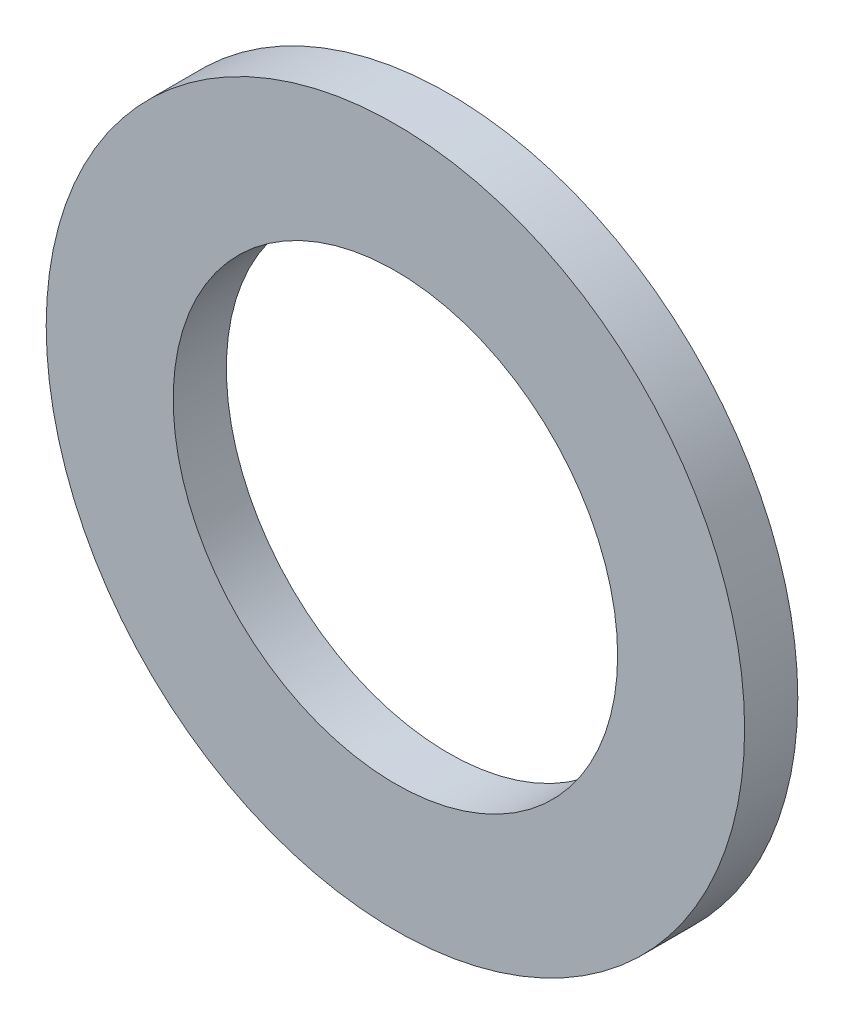
ISO-10303-21;
HEADER;
FILE_DESCRIPTION(('STEP AP214'),'2;1');
FILE_NAME('part.step','',(''),(''),'','','');
FILE_SCHEMA(('AUTOMOTIVE_DESIGN { 1 0 10303 214 1 1 1 1 }'));
ENDSEC;
DATA;
#1=APPLICATION_CONTEXT('core data for automotive mechanical design processes');
#2=APPLICATION_PROTOCOL_DEFINITION('international standard','automotive_design',2000,#1);
#3=PRODUCT_CONTEXT('',#1,'mechanical');
#4=PRODUCT('Part','Part','',(#3));
#5=PRODUCT_RELATED_PRODUCT_CATEGORY('part','',(#4));
#6=PRODUCT_DEFINITION_FORMATION('','',#4);
#7=PRODUCT_DEFINITION_CONTEXT('part definition',#1,'design');
#8=PRODUCT_DEFINITION('design','',#6,#7);
#9=PRODUCT_DEFINITION_SHAPE('','',#8);
#10=(LENGTH_UNIT() NAMED_UNIT(*) SI_UNIT(.MILLI.,.METRE.));
#11=(NAMED_UNIT(*) PLANE_ANGLE_UNIT() SI_UNIT($,.RADIAN.));
#12=(NAMED_UNIT(*) SI_UNIT($,.STERADIAN.) SOLID_ANGLE_UNIT());
#13=UNCERTAINTY_MEASURE_WITH_UNIT(LENGTH_MEASURE(1.E-05),#10,'distance_accuracy_value','');
#14=(GEOMETRIC_REPRESENTATION_CONTEXT(3) GLOBAL_UNCERTAINTY_ASSIGNED_CONTEXT((#13)) GLOBAL_UNIT_ASSIGNED_CONTEXT((#10,
#11,#12)) REPRESENTATION_CONTEXT('',''));
#15=CARTESIAN_POINT('',(0.,0.,0.));
#16=DIRECTION('',(0.,0.,1.));
#17=DIRECTION('',(1.,0.,0.));
#18=AXIS2_PLACEMENT_3D('',#15,#16,#17);
#19=CARTESIAN_POINT('',(0.,0.,3.35));
#20=DIRECTION('',(0.,0.,1.));
#21=DIRECTION('',(1.,0.,0.));
#22=AXIS2_PLACEMENT_3D('',#19,#20,#21);
#23=PLANE('',#22);
#24=CARTESIAN_POINT('',(0.,0.,3.35));
#25=DIRECTION('',(0.,0.,1.));
#26=DIRECTION('',(1.,0.,0.));
#27=AXIS2_PLACEMENT_3D('',#24,#25,#26);
#28=CIRCLE('',#27,22.);
#29=CARTESIAN_POINT('',(22.,0.,3.35));
#30=VERTEX_POINT('',#29);
#31=EDGE_CURVE('E11',#30,#30,#28,.T.);
#32=ORIENTED_EDGE('',*,*,#31,.T.);
#33=EDGE_LOOP('',(#32));
#34=FACE_BOUND('',#33,.T.);
#35=CARTESIAN_POINT('',(0.,0.,3.35));
#36=DIRECTION('',(0.,0.,1.));
#37=DIRECTION('',(1.,0.,0.));
#38=AXIS2_PLACEMENT_3D('',#35,#36,#37);
#39=CIRCLE('',#38,14.);
#40=CARTESIAN_POINT('',(14.,0.,3.35));
#41=VERTEX_POINT('',#40);
#42=EDGE_CURVE('E58',#41,#41,#39,.T.);
#43=ORIENTED_EDGE('',*,*,#42,.F.);
#44=EDGE_LOOP('',(#43));
#45=FACE_BOUND('',#44,.T.);
#46=ADVANCED_FACE('F47',(#34,#45),#23,.T.);
#47=CARTESIAN_POINT('',(0.,0.,0.));
#48=DIRECTION('',(0.,0.,1.));
#49=DIRECTION('',(1.,0.,0.));
#50=AXIS2_PLACEMENT_3D('',#47,#48,#49);
#51=PLANE('',#50);
#52=CARTESIAN_POINT('',(0.,0.,0.));
#53=DIRECTION('',(0.,0.,1.));
#54=DIRECTION('',(1.,0.,0.));
#55=AXIS2_PLACEMENT_3D('',#52,#53,#54);
#56=CIRCLE('',#55,22.);
#57=CARTESIAN_POINT('',(22.,0.,0.));
#58=VERTEX_POINT('',#57);
#59=EDGE_CURVE('E51',#58,#58,#56,.T.);
#60=ORIENTED_EDGE('',*,*,#59,.F.);
#61=EDGE_LOOP('',(#60));
#62=FACE_BOUND('',#61,.T.);
#63=CARTESIAN_POINT('',(0.,0.,0.));
#64=DIRECTION('',(0.,0.,1.));
#65=DIRECTION('',(1.,0.,0.));
#66=AXIS2_PLACEMENT_3D('',#63,#64,#65);
#67=CIRCLE('',#66,14.);
#68=CARTESIAN_POINT('',(14.,0.,0.));
#69=VERTEX_POINT('',#68);
#70=EDGE_CURVE('E60',#69,#69,#67,.T.);
#71=ORIENTED_EDGE('',*,*,#70,.T.);
#72=EDGE_LOOP('',(#71));
#73=FACE_BOUND('',#72,.T.);
#74=ADVANCED_FACE('F70',(#62,#73),#51,.F.);
#75=CARTESIAN_POINT('',(0.,0.,3.35));
#76=DIRECTION('',(0.,0.,-1.));
#77=DIRECTION('',(-1.,0.,0.));
#78=AXIS2_PLACEMENT_3D('',#75,#76,#77);
#79=CYLINDRICAL_SURFACE('',#78,22.);
#80=ORIENTED_EDGE('',*,*,#31,.F.);
#81=EDGE_LOOP('',(#80));
#82=FACE_BOUND('',#81,.T.);
#83=ORIENTED_EDGE('',*,*,#59,.T.);
#84=EDGE_LOOP('',(#83));
#85=FACE_BOUND('',#84,.T.);
#86=ADVANCED_FACE('F49',(#82,#85),#79,.T.);
#87=CARTESIAN_POINT('',(0.,0.,3.35));
#88=DIRECTION('',(0.,0.,-1.));
#89=DIRECTION('',(-1.,0.,0.));
#90=AXIS2_PLACEMENT_3D('',#87,#88,#89);
#91=CYLINDRICAL_SURFACE('',#90,14.);
#92=ORIENTED_EDGE('',*,*,#42,.T.);
#93=EDGE_LOOP('',(#92));
#94=FACE_BOUND('',#93,.T.);
#95=ORIENTED_EDGE('',*,*,#70,.F.);
#96=EDGE_LOOP('',(#95));
#97=FACE_BOUND('',#96,.T.);
#98=ADVANCED_FACE('F66',(#94,#97),#91,.F.);
#99=CLOSED_SHELL('',(#46,#74,#86,#98));
#100=MANIFOLD_SOLID_BREP('B2',#99);
#101=ADVANCED_BREP_SHAPE_REPRESENTATION('',(#18,#100),#14);
#102=SHAPE_DEFINITION_REPRESENTATION(#9,#101);
ENDSEC;
END-ISO-10303-21;
